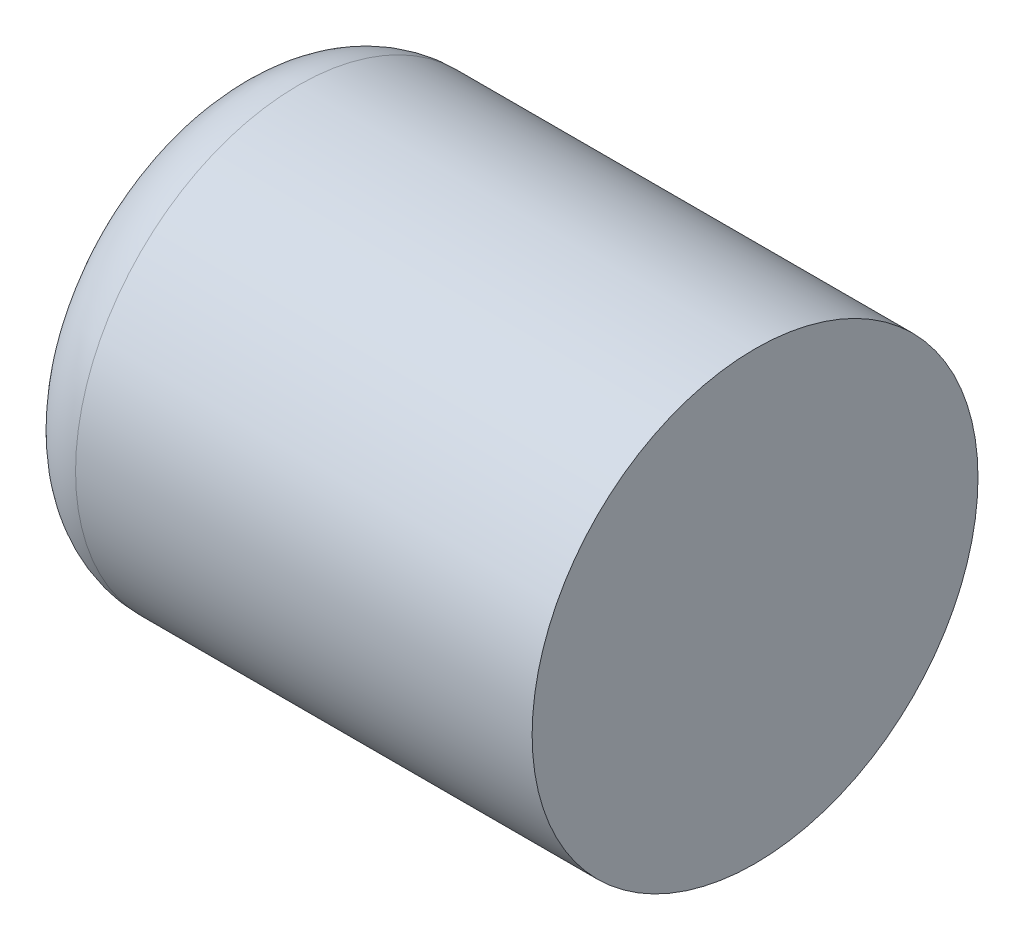
ISO-10303-21;
HEADER;
FILE_DESCRIPTION(('STEP AP214'),'2;1');
FILE_NAME('part.step','',(''),(''),'','','');
FILE_SCHEMA(('AUTOMOTIVE_DESIGN { 1 0 10303 214 1 1 1 1 }'));
ENDSEC;
DATA;
#1=APPLICATION_CONTEXT('core data for automotive mechanical design processes');
#2=APPLICATION_PROTOCOL_DEFINITION('international standard','automotive_design',2000,#1);
#3=PRODUCT_CONTEXT('',#1,'mechanical');
#4=PRODUCT('Part','Part','',(#3));
#5=PRODUCT_RELATED_PRODUCT_CATEGORY('part','',(#4));
#6=PRODUCT_DEFINITION_FORMATION('','',#4);
#7=PRODUCT_DEFINITION_CONTEXT('part definition',#1,'design');
#8=PRODUCT_DEFINITION('design','',#6,#7);
#9=PRODUCT_DEFINITION_SHAPE('','',#8);
#10=(LENGTH_UNIT() NAMED_UNIT(*) SI_UNIT(.MILLI.,.METRE.));
#11=(NAMED_UNIT(*) PLANE_ANGLE_UNIT() SI_UNIT($,.RADIAN.));
#12=(NAMED_UNIT(*) SI_UNIT($,.STERADIAN.) SOLID_ANGLE_UNIT());
#13=UNCERTAINTY_MEASURE_WITH_UNIT(LENGTH_MEASURE(1.E-05),#10,'distance_accuracy_value','');
#14=(GEOMETRIC_REPRESENTATION_CONTEXT(3) GLOBAL_UNCERTAINTY_ASSIGNED_CONTEXT((#13)) GLOBAL_UNIT_ASSIGNED_CONTEXT((#10,
#11,#12)) REPRESENTATION_CONTEXT('',''));
#15=CARTESIAN_POINT('',(0.,0.,0.));
#16=DIRECTION('',(0.,0.,1.));
#17=DIRECTION('',(1.,0.,0.));
#18=AXIS2_PLACEMENT_3D('',#15,#16,#17);
#19=CARTESIAN_POINT('',(-0.374364285309383,-0.332340218761648,0.1012));
#20=DIRECTION('',(1.,0.,0.));
#21=DIRECTION('',(0.,1.,0.));
#22=AXIS2_PLACEMENT_3D('',#19,#20,#21);
#23=PLANE('',#22);
#24=CARTESIAN_POINT('',(-0.374364285309383,-0.332340218761648,0.1012));
#25=DIRECTION('',(1.,0.,0.));
#26=DIRECTION('',(0.,0.,-1.));
#27=AXIS2_PLACEMENT_3D('',#24,#25,#26);
#28=CIRCLE('',#27,0.0212499999999999);
#29=CARTESIAN_POINT('',(-0.374364285309383,-0.332340218761648,0.0799500000000001));
#30=VERTEX_POINT('',#29);
#31=CARTESIAN_POINT('',(-0.374364285309383,-0.311090218761648,0.1012));
#32=VERTEX_POINT('',#31);
#33=EDGE_CURVE('E35',#30,#32,#28,.T.);
#34=ORIENTED_EDGE('',*,*,#33,.F.);
#35=CARTESIAN_POINT('',(-0.374364285309383,-0.332340218761648,0.1012));
#36=DIRECTION('',(1.,0.,0.));
#37=DIRECTION('',(0.,0.,1.));
#38=AXIS2_PLACEMENT_3D('',#35,#36,#37);
#39=CIRCLE('',#38,0.02125);
#40=CARTESIAN_POINT('',(-0.374364285309383,-0.332340218761648,0.12245));
#41=VERTEX_POINT('',#40);
#42=EDGE_CURVE('E44',#41,#30,#39,.T.);
#43=ORIENTED_EDGE('',*,*,#42,.F.);
#44=CARTESIAN_POINT('',(-0.374364285309383,-0.332340218761648,0.1012));
#45=DIRECTION('',(1.,0.,0.));
#46=DIRECTION('',(0.,1.,0.));
#47=AXIS2_PLACEMENT_3D('',#44,#45,#46);
#48=CIRCLE('',#47,0.02125);
#49=EDGE_CURVE('E42',#32,#41,#48,.T.);
#50=ORIENTED_EDGE('',*,*,#49,.F.);
#51=EDGE_LOOP('',(#34,#43,#50));
#52=FACE_BOUND('',#51,.T.);
#53=ADVANCED_FACE('F17',(#52),#23,.F.);
#54=CARTESIAN_POINT('',(-0.364364285309383,-0.332340218761648,0.1012));
#55=DIRECTION('',(1.,0.,0.));
#56=DIRECTION('',(0.,0.,1.));
#57=AXIS2_PLACEMENT_3D('',#54,#55,#56);
#58=TOROIDAL_SURFACE('',#57,0.02125,0.01);
#59=ORIENTED_EDGE('',*,*,#49,.T.);
#60=ORIENTED_EDGE('',*,*,#42,.T.);
#61=ORIENTED_EDGE('',*,*,#33,.T.);
#62=EDGE_LOOP('',(#59,#60,#61));
#63=FACE_BOUND('',#62,.T.);
#64=CARTESIAN_POINT('',(-0.364364285309383,-0.332340218761648,0.1012));
#65=DIRECTION('',(1.,0.,0.));
#66=DIRECTION('',(0.,1.,0.));
#67=AXIS2_PLACEMENT_3D('',#64,#65,#66);
#68=CIRCLE('',#67,0.03125);
#69=CARTESIAN_POINT('',(-0.364364285309383,-0.301090218761648,0.1012));
#70=VERTEX_POINT('',#69);
#71=EDGE_CURVE('E27',#70,#70,#68,.T.);
#72=ORIENTED_EDGE('',*,*,#71,.F.);
#73=EDGE_LOOP('',(#72));
#74=FACE_BOUND('',#73,.T.);
#75=ADVANCED_FACE('F49',(#63,#74),#58,.T.);
#76=CARTESIAN_POINT('',(-0.300364285309383,-0.332340218761648,0.1012));
#77=DIRECTION('',(-1.,0.,0.));
#78=DIRECTION('',(0.,-1.,0.));
#79=AXIS2_PLACEMENT_3D('',#76,#77,#78);
#80=PLANE('',#79);
#81=CARTESIAN_POINT('',(-0.300364285309383,-0.332340218761648,0.1012));
#82=DIRECTION('',(1.,0.,0.));
#83=DIRECTION('',(0.,1.,0.));
#84=AXIS2_PLACEMENT_3D('',#81,#82,#83);
#85=CIRCLE('',#84,0.03125);
#86=CARTESIAN_POINT('',(-0.300364285309383,-0.301090218761648,0.1012));
#87=VERTEX_POINT('',#86);
#88=EDGE_CURVE('E11',#87,#87,#85,.F.);
#89=ORIENTED_EDGE('',*,*,#88,.F.);
#90=EDGE_LOOP('',(#89));
#91=FACE_BOUND('',#90,.T.);
#92=ADVANCED_FACE('F65',(#91),#80,.F.);
#93=CARTESIAN_POINT('',(-0.270364285309383,-0.332340218761648,0.1012));
#94=DIRECTION('',(1.,0.,0.));
#95=DIRECTION('',(0.,1.,0.));
#96=AXIS2_PLACEMENT_3D('',#93,#94,#95);
#97=CYLINDRICAL_SURFACE('',#96,0.03125);
#98=ORIENTED_EDGE('',*,*,#71,.T.);
#99=EDGE_LOOP('',(#98));
#100=FACE_BOUND('',#99,.T.);
#101=ORIENTED_EDGE('',*,*,#88,.T.);
#102=EDGE_LOOP('',(#101));
#103=FACE_BOUND('',#102,.T.);
#104=ADVANCED_FACE('F89',(#100,#103),#97,.T.);
#105=CLOSED_SHELL('',(#53,#75,#92,#104));
#106=MANIFOLD_SOLID_BREP('B1',#105);
#107=ADVANCED_BREP_SHAPE_REPRESENTATION('',(#18,#106),#14);
#108=SHAPE_DEFINITION_REPRESENTATION(#9,#107);
ENDSEC;
END-ISO-10303-21;
